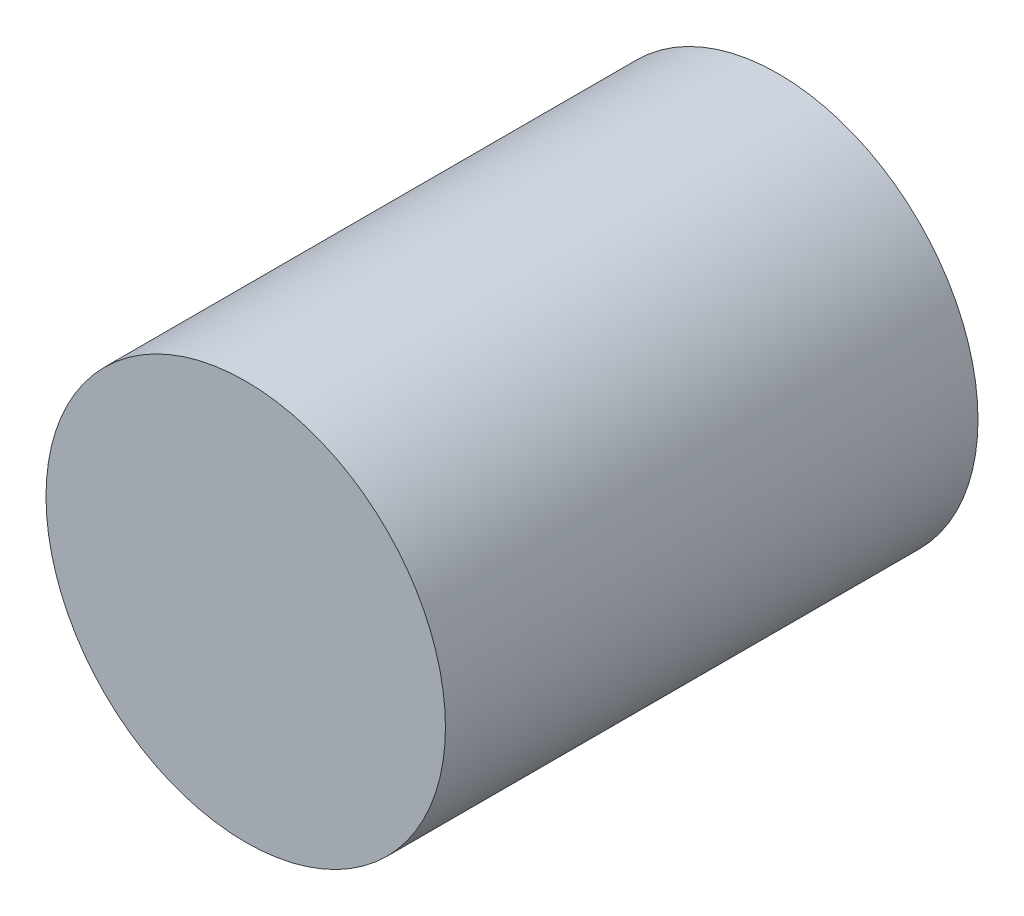
ISO-10303-21;
HEADER;
FILE_DESCRIPTION(('STEP AP214'),'2;1');
FILE_NAME('part.step','',(''),(''),'','','');
FILE_SCHEMA(('AUTOMOTIVE_DESIGN { 1 0 10303 214 1 1 1 1 }'));
ENDSEC;
DATA;
#1=APPLICATION_CONTEXT('core data for automotive mechanical design processes');
#2=APPLICATION_PROTOCOL_DEFINITION('international standard','automotive_design',2000,#1);
#3=PRODUCT_CONTEXT('',#1,'mechanical');
#4=PRODUCT('Part','Part','',(#3));
#5=PRODUCT_RELATED_PRODUCT_CATEGORY('part','',(#4));
#6=PRODUCT_DEFINITION_FORMATION('','',#4);
#7=PRODUCT_DEFINITION_CONTEXT('part definition',#1,'design');
#8=PRODUCT_DEFINITION('design','',#6,#7);
#9=PRODUCT_DEFINITION_SHAPE('','',#8);
#10=(LENGTH_UNIT() NAMED_UNIT(*) SI_UNIT(.MILLI.,.METRE.));
#11=(NAMED_UNIT(*) PLANE_ANGLE_UNIT() SI_UNIT($,.RADIAN.));
#12=(NAMED_UNIT(*) SI_UNIT($,.STERADIAN.) SOLID_ANGLE_UNIT());
#13=UNCERTAINTY_MEASURE_WITH_UNIT(LENGTH_MEASURE(1.E-05),#10,'distance_accuracy_value','');
#14=(GEOMETRIC_REPRESENTATION_CONTEXT(3) GLOBAL_UNCERTAINTY_ASSIGNED_CONTEXT((#13)) GLOBAL_UNIT_ASSIGNED_CONTEXT((#10,
#11,#12)) REPRESENTATION_CONTEXT('',''));
#15=CARTESIAN_POINT('',(0.,0.,0.));
#16=DIRECTION('',(0.,0.,1.));
#17=DIRECTION('',(1.,0.,0.));
#18=AXIS2_PLACEMENT_3D('',#15,#16,#17);
#19=CARTESIAN_POINT('',(0.,0.,12.7));
#20=DIRECTION('',(0.,0.,-1.));
#21=DIRECTION('',(-1.,0.,0.));
#22=AXIS2_PLACEMENT_3D('',#19,#20,#21);
#23=CYLINDRICAL_SURFACE('',#22,4.7625);
#24=CARTESIAN_POINT('',(0.,0.,12.7));
#25=DIRECTION('',(0.,0.,1.));
#26=DIRECTION('',(1.,0.,0.));
#27=AXIS2_PLACEMENT_3D('',#24,#25,#26);
#28=CIRCLE('',#27,4.7625);
#29=CARTESIAN_POINT('',(4.7625,0.,12.7));
#30=VERTEX_POINT('',#29);
#31=EDGE_CURVE('E10',#30,#30,#28,.T.);
#32=ORIENTED_EDGE('',*,*,#31,.F.);
#33=EDGE_LOOP('',(#32));
#34=FACE_BOUND('',#33,.T.);
#35=CARTESIAN_POINT('',(0.,0.,0.));
#36=DIRECTION('',(0.,0.,1.));
#37=DIRECTION('',(1.,0.,0.));
#38=AXIS2_PLACEMENT_3D('',#35,#36,#37);
#39=CIRCLE('',#38,4.7625);
#40=CARTESIAN_POINT('',(4.7625,0.,0.));
#41=VERTEX_POINT('',#40);
#42=EDGE_CURVE('E33',#41,#41,#39,.T.);
#43=ORIENTED_EDGE('',*,*,#42,.T.);
#44=EDGE_LOOP('',(#43));
#45=FACE_BOUND('',#44,.T.);
#46=ADVANCED_FACE('F30',(#34,#45),#23,.T.);
#47=CARTESIAN_POINT('',(0.,0.,12.7));
#48=DIRECTION('',(0.,0.,1.));
#49=DIRECTION('',(1.,0.,0.));
#50=AXIS2_PLACEMENT_3D('',#47,#48,#49);
#51=PLANE('',#50);
#52=ORIENTED_EDGE('',*,*,#31,.T.);
#53=EDGE_LOOP('',(#52));
#54=FACE_BOUND('',#53,.T.);
#55=ADVANCED_FACE('F45',(#54),#51,.T.);
#56=CARTESIAN_POINT('',(0.,0.,0.));
#57=DIRECTION('',(0.,0.,1.));
#58=DIRECTION('',(1.,0.,0.));
#59=AXIS2_PLACEMENT_3D('',#56,#57,#58);
#60=PLANE('',#59);
#61=ORIENTED_EDGE('',*,*,#42,.F.);
#62=EDGE_LOOP('',(#61));
#63=FACE_BOUND('',#62,.T.);
#64=ADVANCED_FACE('F43',(#63),#60,.F.);
#65=CLOSED_SHELL('',(#46,#55,#64));
#66=MANIFOLD_SOLID_BREP('B2',#65);
#67=ADVANCED_BREP_SHAPE_REPRESENTATION('',(#18,#66),#14);
#68=SHAPE_DEFINITION_REPRESENTATION(#9,#67);
ENDSEC;
END-ISO-10303-21;
